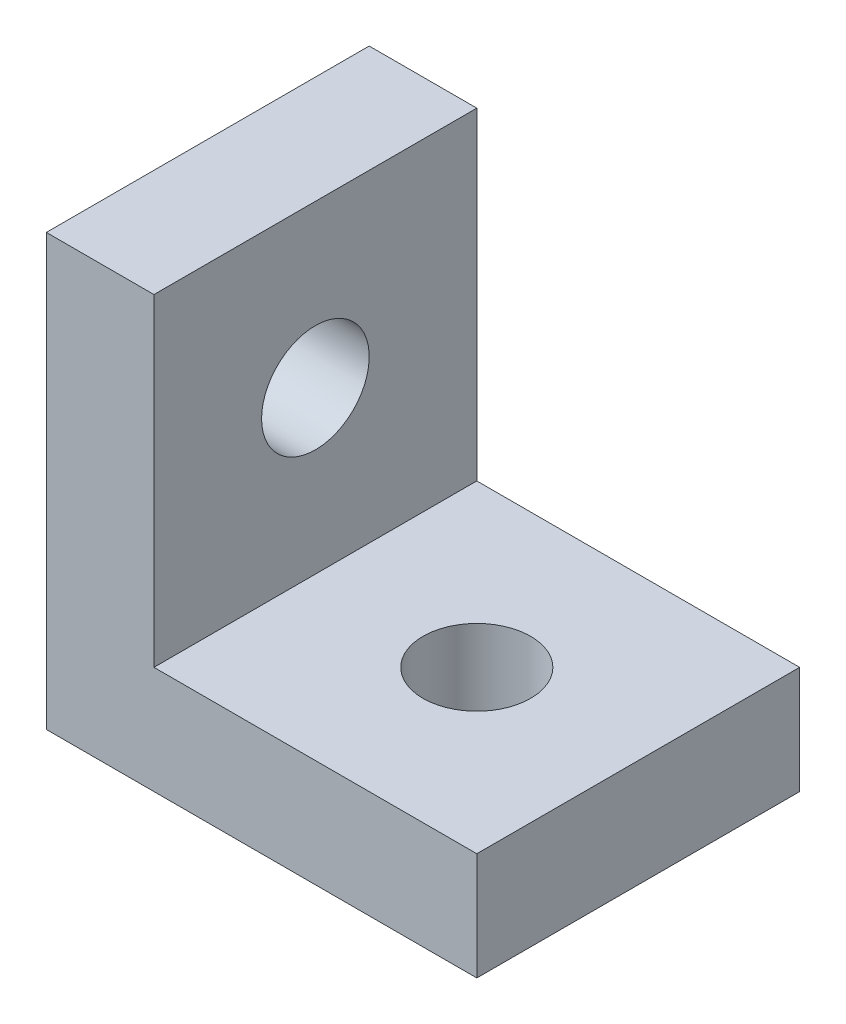
ISO-10303-21;
HEADER;
FILE_DESCRIPTION(('STEP AP214'),'2;1');
FILE_NAME('part.step','',(''),(''),'','','');
FILE_SCHEMA(('AUTOMOTIVE_DESIGN { 1 0 10303 214 1 1 1 1 }'));
ENDSEC;
DATA;
#1=APPLICATION_CONTEXT('core data for automotive mechanical design processes');
#2=APPLICATION_PROTOCOL_DEFINITION('international standard','automotive_design',2000,#1);
#3=PRODUCT_CONTEXT('',#1,'mechanical');
#4=PRODUCT('Part','Part','',(#3));
#5=PRODUCT_RELATED_PRODUCT_CATEGORY('part','',(#4));
#6=PRODUCT_DEFINITION_FORMATION('','',#4);
#7=PRODUCT_DEFINITION_CONTEXT('part definition',#1,'design');
#8=PRODUCT_DEFINITION('design','',#6,#7);
#9=PRODUCT_DEFINITION_SHAPE('','',#8);
#10=(LENGTH_UNIT() NAMED_UNIT(*) SI_UNIT(.MILLI.,.METRE.));
#11=(NAMED_UNIT(*) PLANE_ANGLE_UNIT() SI_UNIT($,.RADIAN.));
#12=(NAMED_UNIT(*) SI_UNIT($,.STERADIAN.) SOLID_ANGLE_UNIT());
#13=UNCERTAINTY_MEASURE_WITH_UNIT(LENGTH_MEASURE(1.E-05),#10,'distance_accuracy_value','');
#14=(GEOMETRIC_REPRESENTATION_CONTEXT(3) GLOBAL_UNCERTAINTY_ASSIGNED_CONTEXT((#13)) GLOBAL_UNIT_ASSIGNED_CONTEXT((#10,
#11,#12)) REPRESENTATION_CONTEXT('',''));
#15=CARTESIAN_POINT('',(0.,0.,0.));
#16=DIRECTION('',(0.,0.,1.));
#17=DIRECTION('',(1.,0.,0.));
#18=AXIS2_PLACEMENT_3D('',#15,#16,#17);
#19=CARTESIAN_POINT('',(40.,0.,30.));
#20=DIRECTION('',(0.,1.,0.));
#21=DIRECTION('',(0.,0.,1.));
#22=AXIS2_PLACEMENT_3D('',#19,#20,#21);
#23=PLANE('',#22);
#24=CARTESIAN_POINT('',(25.,-1.2490009027033E-13,15.));
#25=DIRECTION('',(0.,1.,0.));
#26=DIRECTION('',(0.,0.,1.));
#27=AXIS2_PLACEMENT_3D('',#24,#25,#26);
#28=CIRCLE('',#27,5.);
#29=CARTESIAN_POINT('',(25.,-1.2490009027033E-13,20.));
#30=VERTEX_POINT('',#29);
#31=EDGE_CURVE('E135',#30,#30,#28,.T.);
#32=ORIENTED_EDGE('',*,*,#31,.T.);
#33=EDGE_LOOP('',(#32));
#34=FACE_BOUND('',#33,.T.);
#35=DIRECTION('',(1.,0.,0.));
#36=VECTOR('',#35,1.);
#37=CARTESIAN_POINT('',(40.,0.,0.));
#38=LINE('',#37,#36);
#39=CARTESIAN_POINT('',(0.,0.,0.));
#40=VERTEX_POINT('',#39);
#41=CARTESIAN_POINT('',(40.,0.,0.));
#42=VERTEX_POINT('',#41);
#43=EDGE_CURVE('E138',#40,#42,#38,.T.);
#44=ORIENTED_EDGE('',*,*,#43,.T.);
#45=DIRECTION('',(0.,0.,-1.));
#46=VECTOR('',#45,1.);
#47=CARTESIAN_POINT('',(40.,0.,30.));
#48=LINE('',#47,#46);
#49=CARTESIAN_POINT('',(40.,0.,30.));
#50=VERTEX_POINT('',#49);
#51=EDGE_CURVE('E11',#50,#42,#48,.T.);
#52=ORIENTED_EDGE('',*,*,#51,.F.);
#53=DIRECTION('',(1.,0.,0.));
#54=VECTOR('',#53,1.);
#55=CARTESIAN_POINT('',(40.,0.,30.));
#56=LINE('',#55,#54);
#57=CARTESIAN_POINT('',(0.,0.,30.));
#58=VERTEX_POINT('',#57);
#59=EDGE_CURVE('E52',#58,#50,#56,.T.);
#60=ORIENTED_EDGE('',*,*,#59,.F.);
#61=DIRECTION('',(0.,0.,-1.));
#62=VECTOR('',#61,1.);
#63=CARTESIAN_POINT('',(0.,0.,30.));
#64=LINE('',#63,#62);
#65=EDGE_CURVE('E71',#58,#40,#64,.T.);
#66=ORIENTED_EDGE('',*,*,#65,.T.);
#67=EDGE_LOOP('',(#44,#52,#60,#66));
#68=FACE_BOUND('',#67,.T.);
#69=ADVANCED_FACE('F36',(#34,#68),#23,.F.);
#70=CARTESIAN_POINT('',(40.,10.,30.));
#71=DIRECTION('',(-1.,0.,0.));
#72=DIRECTION('',(0.,0.,1.));
#73=AXIS2_PLACEMENT_3D('',#70,#71,#72);
#74=PLANE('',#73);
#75=DIRECTION('',(0.,1.,0.));
#76=VECTOR('',#75,1.);
#77=CARTESIAN_POINT('',(40.,10.,0.));
#78=LINE('',#77,#76);
#79=CARTESIAN_POINT('',(40.,10.,0.));
#80=VERTEX_POINT('',#79);
#81=EDGE_CURVE('E66',#42,#80,#78,.T.);
#82=ORIENTED_EDGE('',*,*,#81,.T.);
#83=DIRECTION('',(0.,0.,-1.));
#84=VECTOR('',#83,1.);
#85=CARTESIAN_POINT('',(40.,10.,30.));
#86=LINE('',#85,#84);
#87=CARTESIAN_POINT('',(40.,10.,30.));
#88=VERTEX_POINT('',#87);
#89=EDGE_CURVE('E44',#88,#80,#86,.T.);
#90=ORIENTED_EDGE('',*,*,#89,.F.);
#91=DIRECTION('',(0.,1.,0.));
#92=VECTOR('',#91,1.);
#93=CARTESIAN_POINT('',(40.,10.,30.));
#94=LINE('',#93,#92);
#95=EDGE_CURVE('E76',#50,#88,#94,.T.);
#96=ORIENTED_EDGE('',*,*,#95,.F.);
#97=ORIENTED_EDGE('',*,*,#51,.T.);
#98=EDGE_LOOP('',(#82,#90,#96,#97));
#99=FACE_BOUND('',#98,.T.);
#100=ADVANCED_FACE('F168',(#99),#74,.F.);
#101=CARTESIAN_POINT('',(10.0000000000001,9.99999999999999,30.));
#102=DIRECTION('',(0.,-1.,0.));
#103=DIRECTION('',(0.,0.,-1.));
#104=AXIS2_PLACEMENT_3D('',#101,#102,#103);
#105=PLANE('',#104);
#106=CARTESIAN_POINT('',(25.,9.99999999999988,15.));
#107=DIRECTION('',(0.,1.,0.));
#108=DIRECTION('',(0.,0.,1.));
#109=AXIS2_PLACEMENT_3D('',#106,#107,#108);
#110=CIRCLE('',#109,5.);
#111=CARTESIAN_POINT('',(25.,9.99999999999988,20.));
#112=VERTEX_POINT('',#111);
#113=EDGE_CURVE('E112',#112,#112,#110,.T.);
#114=ORIENTED_EDGE('',*,*,#113,.F.);
#115=EDGE_LOOP('',(#114));
#116=FACE_BOUND('',#115,.T.);
#117=DIRECTION('',(-1.,0.,0.));
#118=VECTOR('',#117,1.);
#119=CARTESIAN_POINT('',(10.0000000000001,9.99999999999999,0.));
#120=LINE('',#119,#118);
#121=CARTESIAN_POINT('',(10.0000000000001,9.99999999999999,0.));
#122=VERTEX_POINT('',#121);
#123=EDGE_CURVE('E140',#80,#122,#120,.T.);
#124=ORIENTED_EDGE('',*,*,#123,.T.);
#125=DIRECTION('',(0.,0.,-1.));
#126=VECTOR('',#125,1.);
#127=CARTESIAN_POINT('',(10.0000000000001,9.99999999999999,30.));
#128=LINE('',#127,#126);
#129=CARTESIAN_POINT('',(10.0000000000001,9.99999999999999,30.));
#130=VERTEX_POINT('',#129);
#131=EDGE_CURVE('E129',#130,#122,#128,.T.);
#132=ORIENTED_EDGE('',*,*,#131,.F.);
#133=DIRECTION('',(-1.,0.,0.));
#134=VECTOR('',#133,1.);
#135=CARTESIAN_POINT('',(10.0000000000001,9.99999999999999,30.));
#136=LINE('',#135,#134);
#137=EDGE_CURVE('E142',#88,#130,#136,.T.);
#138=ORIENTED_EDGE('',*,*,#137,.F.);
#139=ORIENTED_EDGE('',*,*,#89,.T.);
#140=EDGE_LOOP('',(#124,#132,#138,#139));
#141=FACE_BOUND('',#140,.T.);
#142=ADVANCED_FACE('F149',(#116,#141),#105,.F.);
#143=CARTESIAN_POINT('',(0.,0.,30.));
#144=DIRECTION('',(0.,0.,1.));
#145=DIRECTION('',(1.,0.,0.));
#146=AXIS2_PLACEMENT_3D('',#143,#144,#145);
#147=PLANE('',#146);
#148=ORIENTED_EDGE('',*,*,#59,.T.);
#149=ORIENTED_EDGE('',*,*,#95,.T.);
#150=ORIENTED_EDGE('',*,*,#137,.T.);
#151=DIRECTION('',(0.,-1.,0.));
#152=VECTOR('',#151,1.);
#153=CARTESIAN_POINT('',(10.0000000000001,9.99999999999999,30.));
#154=LINE('',#153,#152);
#155=CARTESIAN_POINT('',(10.0000000000004,39.9999999999999,30.));
#156=VERTEX_POINT('',#155);
#157=EDGE_CURVE('E99',#156,#130,#154,.T.);
#158=ORIENTED_EDGE('',*,*,#157,.F.);
#159=DIRECTION('',(1.,0.,0.));
#160=VECTOR('',#159,1.);
#161=CARTESIAN_POINT('',(10.0000000000004,39.9999999999999,30.));
#162=LINE('',#161,#160);
#163=CARTESIAN_POINT('',(4.16333634234434E-13,40.,30.));
#164=VERTEX_POINT('',#163);
#165=EDGE_CURVE('E93',#164,#156,#162,.T.);
#166=ORIENTED_EDGE('',*,*,#165,.F.);
#167=DIRECTION('',(0.,1.,0.));
#168=VECTOR('',#167,1.);
#169=CARTESIAN_POINT('',(4.16333634234434E-13,40.,30.));
#170=LINE('',#169,#168);
#171=EDGE_CURVE('E97',#58,#164,#170,.T.);
#172=ORIENTED_EDGE('',*,*,#171,.F.);
#173=EDGE_LOOP('',(#148,#149,#150,#158,#166,#172));
#174=FACE_BOUND('',#173,.T.);
#175=ADVANCED_FACE('F95',(#174),#147,.T.);
#176=CARTESIAN_POINT('',(0.,0.,0.));
#177=DIRECTION('',(0.,0.,1.));
#178=DIRECTION('',(1.,0.,0.));
#179=AXIS2_PLACEMENT_3D('',#176,#177,#178);
#180=PLANE('',#179);
#181=ORIENTED_EDGE('',*,*,#43,.F.);
#182=DIRECTION('',(0.,1.,0.));
#183=VECTOR('',#182,1.);
#184=CARTESIAN_POINT('',(4.16333634234434E-13,40.,0.));
#185=LINE('',#184,#183);
#186=CARTESIAN_POINT('',(4.16333634234434E-13,40.,0.));
#187=VERTEX_POINT('',#186);
#188=EDGE_CURVE('E125',#40,#187,#185,.T.);
#189=ORIENTED_EDGE('',*,*,#188,.T.);
#190=DIRECTION('',(1.,0.,0.));
#191=VECTOR('',#190,1.);
#192=CARTESIAN_POINT('',(10.0000000000004,39.9999999999999,0.));
#193=LINE('',#192,#191);
#194=CARTESIAN_POINT('',(10.0000000000004,39.9999999999999,0.));
#195=VERTEX_POINT('',#194);
#196=EDGE_CURVE('E108',#187,#195,#193,.T.);
#197=ORIENTED_EDGE('',*,*,#196,.T.);
#198=DIRECTION('',(0.,-1.,0.));
#199=VECTOR('',#198,1.);
#200=CARTESIAN_POINT('',(10.0000000000001,9.99999999999999,0.));
#201=LINE('',#200,#199);
#202=EDGE_CURVE('E116',#195,#122,#201,.T.);
#203=ORIENTED_EDGE('',*,*,#202,.T.);
#204=ORIENTED_EDGE('',*,*,#123,.F.);
#205=ORIENTED_EDGE('',*,*,#81,.F.);
#206=EDGE_LOOP('',(#181,#189,#197,#203,#204,#205));
#207=FACE_BOUND('',#206,.T.);
#208=ADVANCED_FACE('F152',(#207),#180,.F.);
#209=CARTESIAN_POINT('',(25.,-20.,15.));
#210=DIRECTION('',(0.,1.,0.));
#211=DIRECTION('',(0.,0.,1.));
#212=AXIS2_PLACEMENT_3D('',#209,#210,#211);
#213=CYLINDRICAL_SURFACE('',#212,5.);
#214=ORIENTED_EDGE('',*,*,#113,.T.);
#215=EDGE_LOOP('',(#214));
#216=FACE_BOUND('',#215,.T.);
#217=ORIENTED_EDGE('',*,*,#31,.F.);
#218=EDGE_LOOP('',(#217));
#219=FACE_BOUND('',#218,.T.);
#220=ADVANCED_FACE('F175',(#216,#219),#213,.F.);
#221=CARTESIAN_POINT('',(4.16333634234434E-13,40.,30.));
#222=DIRECTION('',(1.,0.,0.));
#223=DIRECTION('',(0.,0.,1.));
#224=AXIS2_PLACEMENT_3D('',#221,#222,#223);
#225=PLANE('',#224);
#226=CARTESIAN_POINT('',(2.63677968348475E-13,25.,15.));
#227=DIRECTION('',(-1.,0.,0.));
#228=DIRECTION('',(0.,0.,1.));
#229=AXIS2_PLACEMENT_3D('',#226,#227,#228);
#230=CIRCLE('',#229,5.);
#231=CARTESIAN_POINT('',(2.63677968348475E-13,25.,20.));
#232=VERTEX_POINT('',#231);
#233=EDGE_CURVE('E121',#232,#232,#230,.T.);
#234=ORIENTED_EDGE('',*,*,#233,.F.);
#235=EDGE_LOOP('',(#234));
#236=FACE_BOUND('',#235,.T.);
#237=ORIENTED_EDGE('',*,*,#188,.F.);
#238=ORIENTED_EDGE('',*,*,#65,.F.);
#239=ORIENTED_EDGE('',*,*,#171,.T.);
#240=DIRECTION('',(0.,0.,-1.));
#241=VECTOR('',#240,1.);
#242=CARTESIAN_POINT('',(4.16333634234434E-13,40.,30.));
#243=LINE('',#242,#241);
#244=EDGE_CURVE('E105',#164,#187,#243,.T.);
#245=ORIENTED_EDGE('',*,*,#244,.T.);
#246=EDGE_LOOP('',(#237,#238,#239,#245));
#247=FACE_BOUND('',#246,.T.);
#248=ADVANCED_FACE('F115',(#236,#247),#225,.F.);
#249=CARTESIAN_POINT('',(10.0000000000004,39.9999999999999,30.));
#250=DIRECTION('',(0.,-1.,0.));
#251=DIRECTION('',(0.,0.,1.));
#252=AXIS2_PLACEMENT_3D('',#249,#250,#251);
#253=PLANE('',#252);
#254=ORIENTED_EDGE('',*,*,#196,.F.);
#255=ORIENTED_EDGE('',*,*,#244,.F.);
#256=ORIENTED_EDGE('',*,*,#165,.T.);
#257=DIRECTION('',(0.,0.,-1.));
#258=VECTOR('',#257,1.);
#259=CARTESIAN_POINT('',(10.0000000000004,39.9999999999999,30.));
#260=LINE('',#259,#258);
#261=EDGE_CURVE('E113',#156,#195,#260,.T.);
#262=ORIENTED_EDGE('',*,*,#261,.T.);
#263=EDGE_LOOP('',(#254,#255,#256,#262));
#264=FACE_BOUND('',#263,.T.);
#265=ADVANCED_FACE('F106',(#264),#253,.F.);
#266=CARTESIAN_POINT('',(10.0000000000001,9.99999999999999,30.));
#267=DIRECTION('',(-1.,0.,0.));
#268=DIRECTION('',(0.,0.,-1.));
#269=AXIS2_PLACEMENT_3D('',#266,#267,#268);
#270=PLANE('',#269);
#271=CARTESIAN_POINT('',(10.0000000000003,24.9999999999998,15.));
#272=DIRECTION('',(-1.,0.,0.));
#273=DIRECTION('',(0.,0.,1.));
#274=AXIS2_PLACEMENT_3D('',#271,#272,#273);
#275=CIRCLE('',#274,5.);
#276=CARTESIAN_POINT('',(10.0000000000003,24.9999999999998,20.));
#277=VERTEX_POINT('',#276);
#278=EDGE_CURVE('E235',#277,#277,#275,.T.);
#279=ORIENTED_EDGE('',*,*,#278,.T.);
#280=EDGE_LOOP('',(#279));
#281=FACE_BOUND('',#280,.T.);
#282=ORIENTED_EDGE('',*,*,#202,.F.);
#283=ORIENTED_EDGE('',*,*,#261,.F.);
#284=ORIENTED_EDGE('',*,*,#157,.T.);
#285=ORIENTED_EDGE('',*,*,#131,.T.);
#286=EDGE_LOOP('',(#282,#283,#284,#285));
#287=FACE_BOUND('',#286,.T.);
#288=ADVANCED_FACE('F154',(#281,#287),#270,.F.);
#289=CARTESIAN_POINT('',(-19.9999999999997,25.0000000000002,15.));
#290=DIRECTION('',(1.,0.,0.));
#291=DIRECTION('',(0.,0.,1.));
#292=AXIS2_PLACEMENT_3D('',#289,#290,#291);
#293=CYLINDRICAL_SURFACE('',#292,5.);
#294=ORIENTED_EDGE('',*,*,#278,.F.);
#295=EDGE_LOOP('',(#294));
#296=FACE_BOUND('',#295,.T.);
#297=ORIENTED_EDGE('',*,*,#233,.T.);
#298=EDGE_LOOP('',(#297));
#299=FACE_BOUND('',#298,.T.);
#300=ADVANCED_FACE('F156',(#296,#299),#293,.F.);
#301=CLOSED_SHELL('',(#69,#100,#142,#175,#208,#220,#248,#265,#288,#300));
#302=MANIFOLD_SOLID_BREP('B2',#301);
#303=ADVANCED_BREP_SHAPE_REPRESENTATION('',(#18,#302),#14);
#304=SHAPE_DEFINITION_REPRESENTATION(#9,#303);
ENDSEC;
END-ISO-10303-21;
